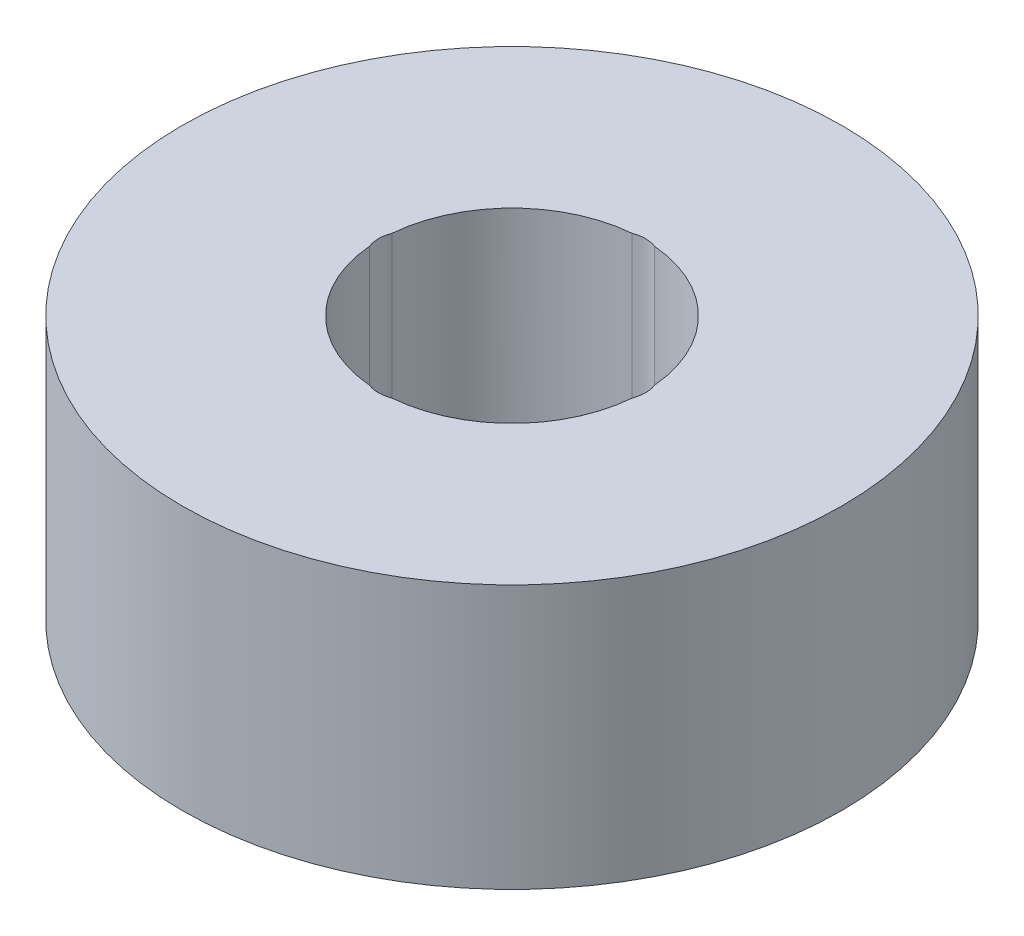
ISO-10303-21;
HEADER;
FILE_DESCRIPTION(('STEP AP214'),'2;1');
FILE_NAME('part.step','',(''),(''),'','','');
FILE_SCHEMA(('AUTOMOTIVE_DESIGN { 1 0 10303 214 1 1 1 1 }'));
ENDSEC;
DATA;
#1=APPLICATION_CONTEXT('core data for automotive mechanical design processes');
#2=APPLICATION_PROTOCOL_DEFINITION('international standard','automotive_design',2000,#1);
#3=PRODUCT_CONTEXT('',#1,'mechanical');
#4=PRODUCT('Part','Part','',(#3));
#5=PRODUCT_RELATED_PRODUCT_CATEGORY('part','',(#4));
#6=PRODUCT_DEFINITION_FORMATION('','',#4);
#7=PRODUCT_DEFINITION_CONTEXT('part definition',#1,'design');
#8=PRODUCT_DEFINITION('design','',#6,#7);
#9=PRODUCT_DEFINITION_SHAPE('','',#8);
#10=(LENGTH_UNIT() NAMED_UNIT(*) SI_UNIT(.MILLI.,.METRE.));
#11=(NAMED_UNIT(*) PLANE_ANGLE_UNIT() SI_UNIT($,.RADIAN.));
#12=(NAMED_UNIT(*) SI_UNIT($,.STERADIAN.) SOLID_ANGLE_UNIT());
#13=UNCERTAINTY_MEASURE_WITH_UNIT(LENGTH_MEASURE(1.E-05),#10,'distance_accuracy_value','');
#14=(GEOMETRIC_REPRESENTATION_CONTEXT(3) GLOBAL_UNCERTAINTY_ASSIGNED_CONTEXT((#13)) GLOBAL_UNIT_ASSIGNED_CONTEXT((#10,
#11,#12)) REPRESENTATION_CONTEXT('',''));
#15=CARTESIAN_POINT('',(0.,0.,0.));
#16=DIRECTION('',(0.,0.,1.));
#17=DIRECTION('',(1.,0.,0.));
#18=AXIS2_PLACEMENT_3D('',#15,#16,#17);
#19=CARTESIAN_POINT('',(0.,20.,0.));
#20=DIRECTION('',(0.,-1.,0.));
#21=DIRECTION('',(0.,0.,-1.));
#22=AXIS2_PLACEMENT_3D('',#19,#20,#21);
#23=CYLINDRICAL_SURFACE('',#22,25.);
#24=CARTESIAN_POINT('',(0.,20.,0.));
#25=DIRECTION('',(0.,1.,0.));
#26=DIRECTION('',(0.,0.,1.));
#27=AXIS2_PLACEMENT_3D('',#24,#25,#26);
#28=CIRCLE('',#27,25.);
#29=CARTESIAN_POINT('',(0.,20.,25.));
#30=VERTEX_POINT('',#29);
#31=EDGE_CURVE('E148',#30,#30,#28,.T.);
#32=ORIENTED_EDGE('',*,*,#31,.F.);
#33=EDGE_LOOP('',(#32));
#34=FACE_BOUND('',#33,.T.);
#35=CARTESIAN_POINT('',(0.,0.,0.));
#36=DIRECTION('',(0.,1.,0.));
#37=DIRECTION('',(0.,0.,1.));
#38=AXIS2_PLACEMENT_3D('',#35,#36,#37);
#39=CIRCLE('',#38,25.);
#40=CARTESIAN_POINT('',(0.,0.,25.));
#41=VERTEX_POINT('',#40);
#42=EDGE_CURVE('E139',#41,#41,#39,.T.);
#43=ORIENTED_EDGE('',*,*,#42,.T.);
#44=EDGE_LOOP('',(#43));
#45=FACE_BOUND('',#44,.T.);
#46=ADVANCED_FACE('F39',(#34,#45),#23,.T.);
#47=CARTESIAN_POINT('',(0.,20.,0.));
#48=DIRECTION('',(0.,1.,0.));
#49=DIRECTION('',(0.,0.,1.));
#50=AXIS2_PLACEMENT_3D('',#47,#48,#49);
#51=PLANE('',#50);
#52=CARTESIAN_POINT('',(0.,20.,7.76388990917989));
#53=DIRECTION('',(0.,1.,0.));
#54=DIRECTION('',(1.,0.,0.));
#55=AXIS2_PLACEMENT_3D('',#52,#53,#54);
#56=CIRCLE('',#55,2.35959358385995);
#57=CARTESIAN_POINT('',(-0.854168617067863,20.,9.96345301457363));
#58=VERTEX_POINT('',#57);
#59=CARTESIAN_POINT('',(0.854168617067932,20.,9.96345301457362));
#60=VERTEX_POINT('',#59);
#61=EDGE_CURVE('E175',#58,#60,#56,.T.);
#62=ORIENTED_EDGE('',*,*,#61,.F.);
#63=CARTESIAN_POINT('',(0.,20.,0.));
#64=DIRECTION('',(0.,1.,0.));
#65=DIRECTION('',(0.,0.,1.));
#66=AXIS2_PLACEMENT_3D('',#63,#64,#65);
#67=CIRCLE('',#66,10.);
#68=CARTESIAN_POINT('',(-9.96345301457363,20.,0.854168617067897));
#69=VERTEX_POINT('',#68);
#70=EDGE_CURVE('E134',#69,#58,#67,.T.);
#71=ORIENTED_EDGE('',*,*,#70,.F.);
#72=CARTESIAN_POINT('',(-7.76388990917989,20.,0.));
#73=DIRECTION('',(0.,1.,0.));
#74=DIRECTION('',(0.,0.,1.));
#75=AXIS2_PLACEMENT_3D('',#72,#73,#74);
#76=CIRCLE('',#75,2.35959358385995);
#77=CARTESIAN_POINT('',(-9.96345301457363,20.,-0.854168617067897));
#78=VERTEX_POINT('',#77);
#79=EDGE_CURVE('E143',#78,#69,#76,.T.);
#80=ORIENTED_EDGE('',*,*,#79,.F.);
#81=CARTESIAN_POINT('',(-0.854168617068002,20.,-9.96345301457362));
#82=VERTEX_POINT('',#81);
#83=EDGE_CURVE('E123',#82,#78,#67,.T.);
#84=ORIENTED_EDGE('',*,*,#83,.F.);
#85=CARTESIAN_POINT('',(0.,20.,-7.76388990917989));
#86=DIRECTION('',(0.,1.,0.));
#87=DIRECTION('',(-1.,0.,0.));
#88=AXIS2_PLACEMENT_3D('',#85,#86,#87);
#89=CIRCLE('',#88,2.35959358385995);
#90=CARTESIAN_POINT('',(0.854168617067793,20.,-9.96345301457364));
#91=VERTEX_POINT('',#90);
#92=EDGE_CURVE('E106',#91,#82,#89,.T.);
#93=ORIENTED_EDGE('',*,*,#92,.F.);
#94=CARTESIAN_POINT('',(9.96345301457363,20.,-0.854168617067897));
#95=VERTEX_POINT('',#94);
#96=EDGE_CURVE('E125',#95,#91,#67,.T.);
#97=ORIENTED_EDGE('',*,*,#96,.F.);
#98=CARTESIAN_POINT('',(7.76388990917989,20.,0.));
#99=DIRECTION('',(0.,1.,0.));
#100=DIRECTION('',(0.,0.,-1.));
#101=AXIS2_PLACEMENT_3D('',#98,#99,#100);
#102=CIRCLE('',#101,2.35959358385995);
#103=CARTESIAN_POINT('',(9.96345301457363,20.,0.854168617067897));
#104=VERTEX_POINT('',#103);
#105=EDGE_CURVE('E286',#104,#95,#102,.T.);
#106=ORIENTED_EDGE('',*,*,#105,.F.);
#107=EDGE_CURVE('E135',#60,#104,#67,.T.);
#108=ORIENTED_EDGE('',*,*,#107,.F.);
#109=EDGE_LOOP('',(#62,#71,#80,#84,#93,#97,#106,#108));
#110=FACE_BOUND('',#109,.T.);
#111=ORIENTED_EDGE('',*,*,#31,.T.);
#112=EDGE_LOOP('',(#111));
#113=FACE_BOUND('',#112,.T.);
#114=ADVANCED_FACE('F118',(#110,#113),#51,.T.);
#115=CARTESIAN_POINT('',(0.,0.,0.));
#116=DIRECTION('',(0.,1.,0.));
#117=DIRECTION('',(0.,0.,1.));
#118=AXIS2_PLACEMENT_3D('',#115,#116,#117);
#119=PLANE('',#118);
#120=CARTESIAN_POINT('',(0.,0.,0.));
#121=DIRECTION('',(0.,1.,0.));
#122=DIRECTION('',(0.,0.,1.));
#123=AXIS2_PLACEMENT_3D('',#120,#121,#122);
#124=CIRCLE('',#123,10.);
#125=CARTESIAN_POINT('',(0.,0.,10.));
#126=VERTEX_POINT('',#125);
#127=EDGE_CURVE('E136',#126,#126,#124,.T.);
#128=ORIENTED_EDGE('',*,*,#127,.T.);
#129=EDGE_LOOP('',(#128));
#130=FACE_BOUND('',#129,.T.);
#131=ORIENTED_EDGE('',*,*,#42,.F.);
#132=EDGE_LOOP('',(#131));
#133=FACE_BOUND('',#132,.T.);
#134=ADVANCED_FACE('F187',(#130,#133),#119,.F.);
#135=CARTESIAN_POINT('',(0.,20.,0.));
#136=DIRECTION('',(0.,-1.,0.));
#137=DIRECTION('',(0.,0.,-1.));
#138=AXIS2_PLACEMENT_3D('',#135,#136,#137);
#139=CYLINDRICAL_SURFACE('',#138,10.);
#140=DIRECTION('',(0.,1.,0.));
#141=VECTOR('',#140,1.);
#142=CARTESIAN_POINT('',(-0.854168617067867,13.2261515469789,9.96345301457363));
#143=LINE('',#142,#141);
#144=CARTESIAN_POINT('',(-0.854168617067863,6.45230309395771,9.96345301457363));
#145=VERTEX_POINT('',#144);
#146=EDGE_CURVE('E11',#145,#58,#143,.T.);
#147=ORIENTED_EDGE('',*,*,#146,.F.);
#148=CARTESIAN_POINT('',(0.,6.45230309395771,0.));
#149=DIRECTION('',(0.,1.,0.));
#150=DIRECTION('',(0.,0.,1.));
#151=AXIS2_PLACEMENT_3D('',#148,#149,#150);
#152=CIRCLE('',#151,10.);
#153=CARTESIAN_POINT('',(0.854168617067932,6.45230309395771,9.96345301457362));
#154=VERTEX_POINT('',#153);
#155=EDGE_CURVE('E170',#145,#154,#152,.T.);
#156=ORIENTED_EDGE('',*,*,#155,.T.);
#157=DIRECTION('',(0.,1.,0.));
#158=VECTOR('',#157,1.);
#159=CARTESIAN_POINT('',(0.854168617067936,13.2261515469789,9.96345301457362));
#160=LINE('',#159,#158);
#161=EDGE_CURVE('E46',#60,#154,#160,.F.);
#162=ORIENTED_EDGE('',*,*,#161,.F.);
#163=ORIENTED_EDGE('',*,*,#107,.T.);
#164=DIRECTION('',(0.,1.,0.));
#165=VECTOR('',#164,1.);
#166=CARTESIAN_POINT('',(9.96345301457363,13.2261515469789,0.854168617067901));
#167=LINE('',#166,#165);
#168=CARTESIAN_POINT('',(9.96345301457363,6.45230309395771,0.854168617067897));
#169=VERTEX_POINT('',#168);
#170=EDGE_CURVE('E164',#169,#104,#167,.T.);
#171=ORIENTED_EDGE('',*,*,#170,.F.);
#172=CARTESIAN_POINT('',(0.,6.45230309395771,0.));
#173=DIRECTION('',(0.,1.,0.));
#174=DIRECTION('',(0.,0.,1.));
#175=AXIS2_PLACEMENT_3D('',#172,#173,#174);
#176=CIRCLE('',#175,10.);
#177=CARTESIAN_POINT('',(9.96345301457363,6.45230309395771,-0.854168617067897));
#178=VERTEX_POINT('',#177);
#179=EDGE_CURVE('E115',#169,#178,#176,.T.);
#180=ORIENTED_EDGE('',*,*,#179,.T.);
#181=DIRECTION('',(0.,1.,0.));
#182=VECTOR('',#181,1.);
#183=CARTESIAN_POINT('',(9.96345301457363,13.2261515469789,-0.854168617067901));
#184=LINE('',#183,#182);
#185=EDGE_CURVE('E131',#95,#178,#184,.F.);
#186=ORIENTED_EDGE('',*,*,#185,.F.);
#187=ORIENTED_EDGE('',*,*,#96,.T.);
#188=DIRECTION('',(0.,1.,0.));
#189=VECTOR('',#188,1.);
#190=CARTESIAN_POINT('',(0.854168617067797,13.2261515469789,-9.96345301457363));
#191=LINE('',#190,#189);
#192=CARTESIAN_POINT('',(0.854168617067793,6.45230309395771,-9.96345301457364));
#193=VERTEX_POINT('',#192);
#194=EDGE_CURVE('E105',#193,#91,#191,.T.);
#195=ORIENTED_EDGE('',*,*,#194,.F.);
#196=CARTESIAN_POINT('',(0.,6.45230309395771,0.));
#197=DIRECTION('',(0.,1.,0.));
#198=DIRECTION('',(0.,0.,1.));
#199=AXIS2_PLACEMENT_3D('',#196,#197,#198);
#200=CIRCLE('',#199,10.);
#201=CARTESIAN_POINT('',(-0.854168617068002,6.45230309395771,-9.96345301457362));
#202=VERTEX_POINT('',#201);
#203=EDGE_CURVE('E159',#193,#202,#200,.T.);
#204=ORIENTED_EDGE('',*,*,#203,.T.);
#205=DIRECTION('',(0.,1.,0.));
#206=VECTOR('',#205,1.);
#207=CARTESIAN_POINT('',(-0.854168617068006,13.2261515469789,-9.96345301457362));
#208=LINE('',#207,#206);
#209=EDGE_CURVE('E114',#82,#202,#208,.F.);
#210=ORIENTED_EDGE('',*,*,#209,.F.);
#211=ORIENTED_EDGE('',*,*,#83,.T.);
#212=DIRECTION('',(0.,1.,0.));
#213=VECTOR('',#212,1.);
#214=CARTESIAN_POINT('',(-9.96345301457363,13.2261515469789,-0.854168617067901));
#215=LINE('',#214,#213);
#216=CARTESIAN_POINT('',(-9.96345301457363,6.45230309395771,-0.854168617067897));
#217=VERTEX_POINT('',#216);
#218=EDGE_CURVE('E160',#217,#78,#215,.T.);
#219=ORIENTED_EDGE('',*,*,#218,.F.);
#220=CARTESIAN_POINT('',(0.,6.45230309395771,0.));
#221=DIRECTION('',(0.,1.,0.));
#222=DIRECTION('',(0.,0.,1.));
#223=AXIS2_PLACEMENT_3D('',#220,#221,#222);
#224=CIRCLE('',#223,10.);
#225=CARTESIAN_POINT('',(-9.96345301457363,6.45230309395771,0.854168617067897));
#226=VERTEX_POINT('',#225);
#227=EDGE_CURVE('E149',#217,#226,#224,.T.);
#228=ORIENTED_EDGE('',*,*,#227,.T.);
#229=DIRECTION('',(0.,1.,0.));
#230=VECTOR('',#229,1.);
#231=CARTESIAN_POINT('',(-9.96345301457363,13.2261515469789,0.854168617067901));
#232=LINE('',#231,#230);
#233=EDGE_CURVE('E152',#69,#226,#232,.F.);
#234=ORIENTED_EDGE('',*,*,#233,.F.);
#235=ORIENTED_EDGE('',*,*,#70,.T.);
#236=EDGE_LOOP('',(#147,#156,#162,#163,#171,#180,#186,#187,#195,#204,#210,#211,#219,#228,#234,#235));
#237=FACE_BOUND('',#236,.T.);
#238=ORIENTED_EDGE('',*,*,#127,.F.);
#239=EDGE_LOOP('',(#238));
#240=FACE_BOUND('',#239,.T.);
#241=ADVANCED_FACE('F126',(#237,#240),#139,.F.);
#242=CARTESIAN_POINT('',(-7.76388990917989,6.45230309395771,0.));
#243=DIRECTION('',(0.,1.,0.));
#244=DIRECTION('',(0.,0.,1.));
#245=AXIS2_PLACEMENT_3D('',#242,#243,#244);
#246=CYLINDRICAL_SURFACE('',#245,2.35959358385995);
#247=ORIENTED_EDGE('',*,*,#218,.T.);
#248=ORIENTED_EDGE('',*,*,#79,.T.);
#249=ORIENTED_EDGE('',*,*,#233,.T.);
#250=CARTESIAN_POINT('',(-7.76388990917989,6.45230309395771,0.));
#251=DIRECTION('',(0.,1.,0.));
#252=DIRECTION('',(0.,0.,1.));
#253=AXIS2_PLACEMENT_3D('',#250,#251,#252);
#254=CIRCLE('',#253,2.35959358385995);
#255=EDGE_CURVE('E144',#217,#226,#254,.T.);
#256=ORIENTED_EDGE('',*,*,#255,.F.);
#257=EDGE_LOOP('',(#247,#248,#249,#256));
#258=FACE_BOUND('',#257,.T.);
#259=ADVANCED_FACE('F200',(#258),#246,.F.);
#260=CARTESIAN_POINT('',(-7.76388990917989,6.45230309395771,0.));
#261=DIRECTION('',(0.,1.,0.));
#262=DIRECTION('',(0.,0.,1.));
#263=AXIS2_PLACEMENT_3D('',#260,#261,#262);
#264=PLANE('',#263);
#265=ORIENTED_EDGE('',*,*,#255,.T.);
#266=ORIENTED_EDGE('',*,*,#227,.F.);
#267=EDGE_LOOP('',(#265,#266));
#268=FACE_BOUND('',#267,.T.);
#269=ADVANCED_FACE('F201',(#268),#264,.T.);
#270=CARTESIAN_POINT('',(0.,6.45230309395771,-7.76388990917989));
#271=DIRECTION('',(0.,1.,0.));
#272=DIRECTION('',(0.,0.,1.));
#273=AXIS2_PLACEMENT_3D('',#270,#271,#272);
#274=CYLINDRICAL_SURFACE('',#273,2.35959358385995);
#275=ORIENTED_EDGE('',*,*,#194,.T.);
#276=ORIENTED_EDGE('',*,*,#92,.T.);
#277=ORIENTED_EDGE('',*,*,#209,.T.);
#278=CARTESIAN_POINT('',(0.,6.45230309395771,-7.76388990917989));
#279=DIRECTION('',(0.,1.,0.));
#280=DIRECTION('',(-1.,0.,0.));
#281=AXIS2_PLACEMENT_3D('',#278,#279,#280);
#282=CIRCLE('',#281,2.35959358385995);
#283=EDGE_CURVE('E107',#193,#202,#282,.T.);
#284=ORIENTED_EDGE('',*,*,#283,.F.);
#285=EDGE_LOOP('',(#275,#276,#277,#284));
#286=FACE_BOUND('',#285,.T.);
#287=ADVANCED_FACE('F102',(#286),#274,.F.);
#288=CARTESIAN_POINT('',(0.,6.45230309395771,-7.76388990917989));
#289=DIRECTION('',(0.,1.,0.));
#290=DIRECTION('',(-1.,0.,0.));
#291=AXIS2_PLACEMENT_3D('',#288,#289,#290);
#292=PLANE('',#291);
#293=ORIENTED_EDGE('',*,*,#283,.T.);
#294=ORIENTED_EDGE('',*,*,#203,.F.);
#295=EDGE_LOOP('',(#293,#294));
#296=FACE_BOUND('',#295,.T.);
#297=ADVANCED_FACE('F209',(#296),#292,.T.);
#298=CARTESIAN_POINT('',(7.76388990917989,6.45230309395771,0.));
#299=DIRECTION('',(0.,1.,0.));
#300=DIRECTION('',(0.,0.,1.));
#301=AXIS2_PLACEMENT_3D('',#298,#299,#300);
#302=CYLINDRICAL_SURFACE('',#301,2.35959358385995);
#303=ORIENTED_EDGE('',*,*,#170,.T.);
#304=ORIENTED_EDGE('',*,*,#105,.T.);
#305=ORIENTED_EDGE('',*,*,#185,.T.);
#306=CARTESIAN_POINT('',(7.76388990917989,6.45230309395771,0.));
#307=DIRECTION('',(0.,1.,0.));
#308=DIRECTION('',(0.,0.,-1.));
#309=AXIS2_PLACEMENT_3D('',#306,#307,#308);
#310=CIRCLE('',#309,2.35959358385995);
#311=EDGE_CURVE('E56',#169,#178,#310,.T.);
#312=ORIENTED_EDGE('',*,*,#311,.F.);
#313=EDGE_LOOP('',(#303,#304,#305,#312));
#314=FACE_BOUND('',#313,.T.);
#315=ADVANCED_FACE('F213',(#314),#302,.F.);
#316=CARTESIAN_POINT('',(7.76388990917989,6.45230309395771,0.));
#317=DIRECTION('',(0.,1.,0.));
#318=DIRECTION('',(0.,0.,-1.));
#319=AXIS2_PLACEMENT_3D('',#316,#317,#318);
#320=PLANE('',#319);
#321=ORIENTED_EDGE('',*,*,#311,.T.);
#322=ORIENTED_EDGE('',*,*,#179,.F.);
#323=EDGE_LOOP('',(#321,#322));
#324=FACE_BOUND('',#323,.T.);
#325=ADVANCED_FACE('F179',(#324),#320,.T.);
#326=CARTESIAN_POINT('',(0.,6.45230309395771,7.76388990917989));
#327=DIRECTION('',(0.,1.,0.));
#328=DIRECTION('',(0.,0.,1.));
#329=AXIS2_PLACEMENT_3D('',#326,#327,#328);
#330=CYLINDRICAL_SURFACE('',#329,2.35959358385995);
#331=ORIENTED_EDGE('',*,*,#146,.T.);
#332=ORIENTED_EDGE('',*,*,#61,.T.);
#333=ORIENTED_EDGE('',*,*,#161,.T.);
#334=CARTESIAN_POINT('',(0.,6.45230309395771,7.76388990917989));
#335=DIRECTION('',(0.,1.,0.));
#336=DIRECTION('',(1.,0.,0.));
#337=AXIS2_PLACEMENT_3D('',#334,#335,#336);
#338=CIRCLE('',#337,2.35959358385995);
#339=EDGE_CURVE('E55',#145,#154,#338,.T.);
#340=ORIENTED_EDGE('',*,*,#339,.F.);
#341=EDGE_LOOP('',(#331,#332,#333,#340));
#342=FACE_BOUND('',#341,.T.);
#343=ADVANCED_FACE('F171',(#342),#330,.F.);
#344=CARTESIAN_POINT('',(0.,6.45230309395771,7.76388990917989));
#345=DIRECTION('',(0.,1.,0.));
#346=DIRECTION('',(1.,0.,0.));
#347=AXIS2_PLACEMENT_3D('',#344,#345,#346);
#348=PLANE('',#347);
#349=ORIENTED_EDGE('',*,*,#339,.T.);
#350=ORIENTED_EDGE('',*,*,#155,.F.);
#351=EDGE_LOOP('',(#349,#350));
#352=FACE_BOUND('',#351,.T.);
#353=ADVANCED_FACE('F173',(#352),#348,.T.);
#354=CLOSED_SHELL('',(#46,#114,#134,#241,#259,#269,#287,#297,#315,#325,#343,#353));
#355=MANIFOLD_SOLID_BREP('B2',#354);
#356=ADVANCED_BREP_SHAPE_REPRESENTATION('',(#18,#355),#14);
#357=SHAPE_DEFINITION_REPRESENTATION(#9,#356);
ENDSEC;
END-ISO-10303-21;
